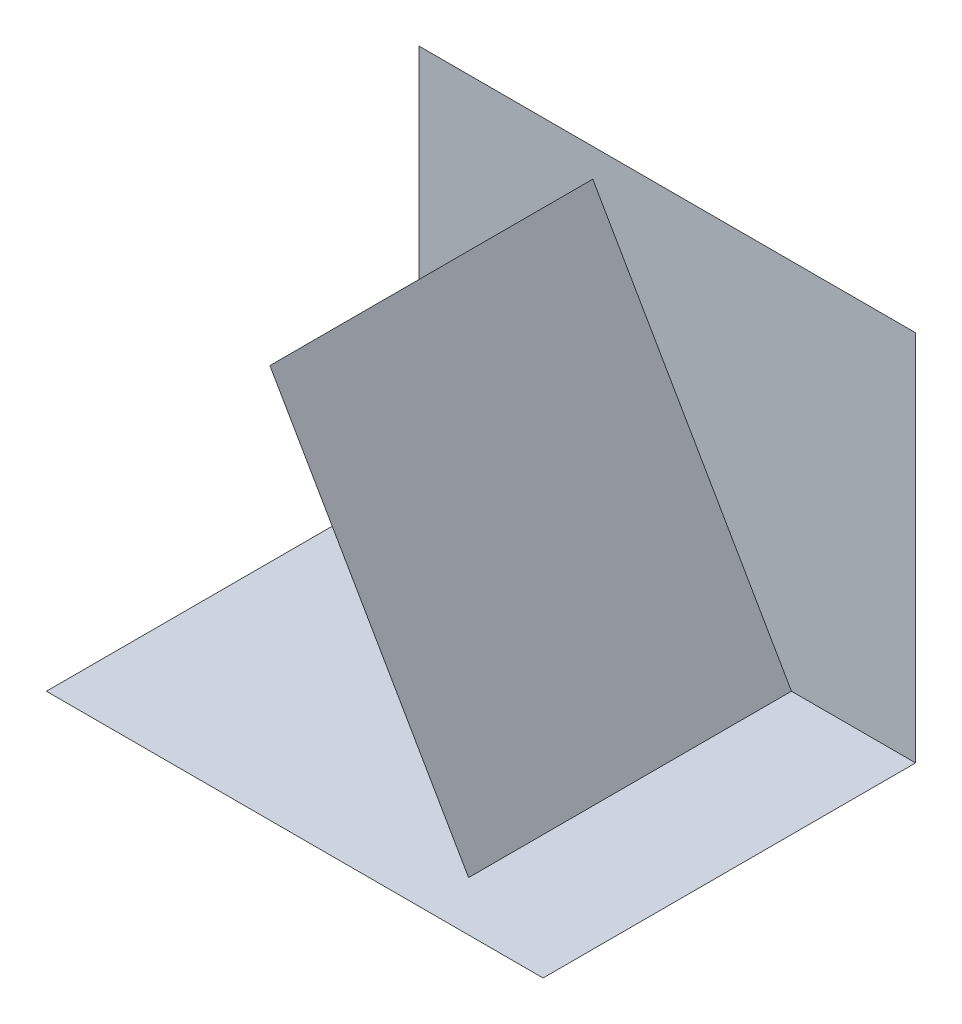
ISO-10303-21;
HEADER;
FILE_DESCRIPTION(('STEP AP214'),'2;1');
FILE_NAME('part.step','',(''),(''),'','','');
FILE_SCHEMA(('AUTOMOTIVE_DESIGN { 1 0 10303 214 1 1 1 1 }'));
ENDSEC;
DATA;
#1=APPLICATION_CONTEXT('core data for automotive mechanical design processes');
#2=APPLICATION_PROTOCOL_DEFINITION('international standard','automotive_design',2000,#1);
#3=PRODUCT_CONTEXT('',#1,'mechanical');
#4=PRODUCT('Part','Part','',(#3));
#5=PRODUCT_RELATED_PRODUCT_CATEGORY('part','',(#4));
#6=PRODUCT_DEFINITION_FORMATION('','',#4);
#7=PRODUCT_DEFINITION_CONTEXT('part definition',#1,'design');
#8=PRODUCT_DEFINITION('design','',#6,#7);
#9=PRODUCT_DEFINITION_SHAPE('','',#8);
#10=(LENGTH_UNIT() NAMED_UNIT(*) SI_UNIT(.MILLI.,.METRE.));
#11=(NAMED_UNIT(*) PLANE_ANGLE_UNIT() SI_UNIT($,.RADIAN.));
#12=(NAMED_UNIT(*) SI_UNIT($,.STERADIAN.) SOLID_ANGLE_UNIT());
#13=UNCERTAINTY_MEASURE_WITH_UNIT(LENGTH_MEASURE(1.E-05),#10,'distance_accuracy_value','');
#14=(GEOMETRIC_REPRESENTATION_CONTEXT(3) GLOBAL_UNCERTAINTY_ASSIGNED_CONTEXT((#13)) GLOBAL_UNIT_ASSIGNED_CONTEXT((#10,
#11,#12)) REPRESENTATION_CONTEXT('',''));
#15=CARTESIAN_POINT('',(0.,0.,0.));
#16=DIRECTION('',(0.,0.,1.));
#17=DIRECTION('',(1.,0.,0.));
#18=AXIS2_PLACEMENT_3D('',#15,#16,#17);
#19=CARTESIAN_POINT('',(-30.0000000000008,138.56406460551,0.));
#20=CARTESIAN_POINT('',(-30.0000000000008,138.56406460551,43.3333333333333));
#21=CARTESIAN_POINT('',(-30.0000000000008,138.56406460551,86.6666666666667));
#22=CARTESIAN_POINT('',(-30.0000000000008,138.56406460551,130.));
#23=CARTESIAN_POINT('',(-3.33333333333385,92.3760430703398,0.));
#24=CARTESIAN_POINT('',(-3.33333333333385,92.3760430703398,43.3333333333333));
#25=CARTESIAN_POINT('',(-3.33333333333386,92.3760430703398,86.6666666666667));
#26=CARTESIAN_POINT('',(-3.33333333333386,92.3760430703399,130.));
#27=CARTESIAN_POINT('',(23.3333333333331,46.1880215351699,0.));
#28=CARTESIAN_POINT('',(23.3333333333331,46.1880215351699,43.3333333333333));
#29=CARTESIAN_POINT('',(23.3333333333331,46.1880215351699,86.6666666666667));
#30=CARTESIAN_POINT('',(23.3333333333331,46.1880215351699,130.));
#31=CARTESIAN_POINT('',(50.,0.,0.));
#32=CARTESIAN_POINT('',(50.,0.,43.3333333333334));
#33=CARTESIAN_POINT('',(50.,0.,86.6666666666667));
#34=CARTESIAN_POINT('',(50.,0.,130.));
#35=B_SPLINE_SURFACE_WITH_KNOTS('',3,3,((#19,#20,#21,#22),(#23,#24,#25,#26),(#27,#28,#29,#30),
(#31,#32,#33,#34)),.UNSPECIFIED.,.F.,.F.,.F.,(4,4),(4,4),(0.,1.),(0.,1.),.UNSPECIFIED.);
#36=CARTESIAN_POINT('',(-30.0000000000008,138.56406460551,0.));
#37=CARTESIAN_POINT('',(-3.33333333333385,92.3760430703398,0.));
#38=CARTESIAN_POINT('',(23.3333333333331,46.1880215351699,0.));
#39=CARTESIAN_POINT('',(50.,0.,0.));
#40=B_SPLINE_CURVE_WITH_KNOTS('',3,(#36,#37,#38,#39),.UNSPECIFIED.,.F.,.F.,(4,4),(0.,1.),.UNSPECIFIED.);
#41=CARTESIAN_POINT('',(-30.0000000000008,138.56406460551,0.));
#42=VERTEX_POINT('',#41);
#43=CARTESIAN_POINT('',(50.,0.,0.));
#44=VERTEX_POINT('',#43);
#45=EDGE_CURVE('E14',#42,#44,#40,.T.);
#46=CARTESIAN_POINT('',(50.,0.,0.));
#47=CARTESIAN_POINT('',(50.,0.,43.3333333333334));
#48=CARTESIAN_POINT('',(50.,0.,86.6666666666667));
#49=CARTESIAN_POINT('',(50.,0.,130.));
#50=B_SPLINE_CURVE_WITH_KNOTS('',3,(#46,#47,#48,#49),.UNSPECIFIED.,.F.,.F.,(4,4),(0.,1.),.UNSPECIFIED.);
#51=CARTESIAN_POINT('',(50.,0.,130.));
#52=VERTEX_POINT('',#51);
#53=EDGE_CURVE('E73',#44,#52,#50,.T.);
#54=CARTESIAN_POINT('',(-30.0000000000008,138.56406460551,130.));
#55=CARTESIAN_POINT('',(-3.33333333333386,92.3760430703399,130.));
#56=CARTESIAN_POINT('',(23.3333333333331,46.1880215351699,130.));
#57=CARTESIAN_POINT('',(50.,0.,130.));
#58=B_SPLINE_CURVE_WITH_KNOTS('',3,(#54,#55,#56,#57),.UNSPECIFIED.,.F.,.F.,(4,4),(0.,1.),.UNSPECIFIED.);
#59=CARTESIAN_POINT('',(-30.0000000000008,138.56406460551,130.));
#60=VERTEX_POINT('',#59);
#61=EDGE_CURVE('E81',#52,#60,#58,.F.);
#62=CARTESIAN_POINT('',(-30.0000000000008,138.56406460551,0.));
#63=CARTESIAN_POINT('',(-30.0000000000008,138.56406460551,43.3333333333333));
#64=CARTESIAN_POINT('',(-30.0000000000008,138.56406460551,86.6666666666667));
#65=CARTESIAN_POINT('',(-30.0000000000008,138.56406460551,130.));
#66=B_SPLINE_CURVE_WITH_KNOTS('',3,(#62,#63,#64,#65),.UNSPECIFIED.,.F.,.F.,(4,4),(0.,1.),.UNSPECIFIED.);
#67=EDGE_CURVE('E65',#60,#42,#66,.F.);
#68=ORIENTED_EDGE('',*,*,#45,.T.);
#69=ORIENTED_EDGE('',*,*,#53,.T.);
#70=ORIENTED_EDGE('',*,*,#61,.T.);
#71=ORIENTED_EDGE('',*,*,#67,.T.);
#72=EDGE_LOOP('',(#68,#69,#70,#71));
#73=FACE_BOUND('',#72,.T.);
#74=ADVANCED_FACE('F62',(#73),#35,.T.);
#75=OPEN_SHELL('',(#74));
#76=SHELL_BASED_SURFACE_MODEL('B2',(#75));
#77=CARTESIAN_POINT('',(-100.,-0.0001,0.));
#78=DIRECTION('',(-1.,0.,0.));
#79=DIRECTION('',(0.,0.,1.));
#80=AXIS2_PLACEMENT_3D('',#77,#78,#79);
#81=PLANE('',#80);
#82=DIRECTION('',(0.,0.,1.));
#83=VECTOR('',#82,1.);
#84=CARTESIAN_POINT('',(-100.,0.,0.));
#85=LINE('',#84,#83);
#86=CARTESIAN_POINT('',(-100.,0.,0.));
#87=VERTEX_POINT('',#86);
#88=CARTESIAN_POINT('',(-100.,0.,150.));
#89=VERTEX_POINT('',#88);
#90=EDGE_CURVE('E180',#87,#89,#85,.T.);
#91=ORIENTED_EDGE('',*,*,#90,.F.);
#92=DIRECTION('',(0.,1.,0.));
#93=VECTOR('',#92,1.);
#94=CARTESIAN_POINT('',(-100.,-0.0001,0.));
#95=LINE('',#94,#93);
#96=CARTESIAN_POINT('',(-100.,-0.0001,0.));
#97=VERTEX_POINT('',#96);
#98=EDGE_CURVE('E60',#97,#87,#95,.T.);
#99=ORIENTED_EDGE('',*,*,#98,.F.);
#100=DIRECTION('',(0.,0.,1.));
#101=VECTOR('',#100,1.);
#102=CARTESIAN_POINT('',(-100.,-0.0001,0.));
#103=LINE('',#102,#101);
#104=CARTESIAN_POINT('',(-100.,-0.0001,150.));
#105=VERTEX_POINT('',#104);
#106=EDGE_CURVE('E182',#97,#105,#103,.T.);
#107=ORIENTED_EDGE('',*,*,#106,.T.);
#108=DIRECTION('',(0.,1.,0.));
#109=VECTOR('',#108,1.);
#110=CARTESIAN_POINT('',(-100.,-0.0001,150.));
#111=LINE('',#110,#109);
#112=EDGE_CURVE('E143',#105,#89,#111,.T.);
#113=ORIENTED_EDGE('',*,*,#112,.T.);
#114=EDGE_LOOP('',(#91,#99,#107,#113));
#115=FACE_BOUND('',#114,.T.);
#116=ADVANCED_FACE('F140',(#115),#81,.T.);
#117=CARTESIAN_POINT('',(-100.,-0.0001,0.));
#118=DIRECTION('',(0.,0.,-1.));
#119=DIRECTION('',(-1.,0.,0.));
#120=AXIS2_PLACEMENT_3D('',#117,#118,#119);
#121=PLANE('',#120);
#122=DIRECTION('',(-1.,0.,0.));
#123=VECTOR('',#122,1.);
#124=CARTESIAN_POINT('',(-100.,0.,0.));
#125=LINE('',#124,#123);
#126=CARTESIAN_POINT('',(100.,0.,0.));
#127=VERTEX_POINT('',#126);
#128=EDGE_CURVE('E197',#127,#87,#125,.T.);
#129=ORIENTED_EDGE('',*,*,#128,.F.);
#130=DIRECTION('',(0.,1.,0.));
#131=VECTOR('',#130,1.);
#132=CARTESIAN_POINT('',(100.,-0.0001,0.));
#133=LINE('',#132,#131);
#134=CARTESIAN_POINT('',(100.,-0.0001,0.));
#135=VERTEX_POINT('',#134);
#136=EDGE_CURVE('E148',#135,#127,#133,.T.);
#137=ORIENTED_EDGE('',*,*,#136,.F.);
#138=DIRECTION('',(-1.,0.,0.));
#139=VECTOR('',#138,1.);
#140=CARTESIAN_POINT('',(-100.,-0.0001,0.));
#141=LINE('',#140,#139);
#142=EDGE_CURVE('E187',#135,#97,#141,.T.);
#143=ORIENTED_EDGE('',*,*,#142,.T.);
#144=ORIENTED_EDGE('',*,*,#98,.T.);
#145=EDGE_LOOP('',(#129,#137,#143,#144));
#146=FACE_BOUND('',#145,.T.);
#147=ADVANCED_FACE('F212',(#146),#121,.T.);
#148=CARTESIAN_POINT('',(100.,-0.0001,0.));
#149=DIRECTION('',(1.,0.,0.));
#150=DIRECTION('',(0.,0.,-1.));
#151=AXIS2_PLACEMENT_3D('',#148,#149,#150);
#152=PLANE('',#151);
#153=DIRECTION('',(0.,0.,-1.));
#154=VECTOR('',#153,1.);
#155=CARTESIAN_POINT('',(100.,0.,0.));
#156=LINE('',#155,#154);
#157=CARTESIAN_POINT('',(100.,0.,150.));
#158=VERTEX_POINT('',#157);
#159=EDGE_CURVE('E194',#158,#127,#156,.T.);
#160=ORIENTED_EDGE('',*,*,#159,.F.);
#161=DIRECTION('',(0.,1.,0.));
#162=VECTOR('',#161,1.);
#163=CARTESIAN_POINT('',(100.,-0.0001,150.));
#164=LINE('',#163,#162);
#165=CARTESIAN_POINT('',(100.,-0.0001,150.));
#166=VERTEX_POINT('',#165);
#167=EDGE_CURVE('E186',#166,#158,#164,.T.);
#168=ORIENTED_EDGE('',*,*,#167,.F.);
#169=DIRECTION('',(0.,0.,-1.));
#170=VECTOR('',#169,1.);
#171=CARTESIAN_POINT('',(100.,-0.0001,0.));
#172=LINE('',#171,#170);
#173=EDGE_CURVE('E205',#166,#135,#172,.T.);
#174=ORIENTED_EDGE('',*,*,#173,.T.);
#175=ORIENTED_EDGE('',*,*,#136,.T.);
#176=EDGE_LOOP('',(#160,#168,#174,#175));
#177=FACE_BOUND('',#176,.T.);
#178=ADVANCED_FACE('F209',(#177),#152,.T.);
#179=CARTESIAN_POINT('',(-100.,-0.0001,150.));
#180=DIRECTION('',(0.,0.,1.));
#181=DIRECTION('',(1.,0.,0.));
#182=AXIS2_PLACEMENT_3D('',#179,#180,#181);
#183=PLANE('',#182);
#184=DIRECTION('',(1.,0.,0.));
#185=VECTOR('',#184,1.);
#186=CARTESIAN_POINT('',(-100.,0.,150.));
#187=LINE('',#186,#185);
#188=EDGE_CURVE('E189',#89,#158,#187,.T.);
#189=ORIENTED_EDGE('',*,*,#188,.F.);
#190=ORIENTED_EDGE('',*,*,#112,.F.);
#191=DIRECTION('',(1.,0.,0.));
#192=VECTOR('',#191,1.);
#193=CARTESIAN_POINT('',(-100.,-0.0001,150.));
#194=LINE('',#193,#192);
#195=EDGE_CURVE('E203',#105,#166,#194,.T.);
#196=ORIENTED_EDGE('',*,*,#195,.T.);
#197=ORIENTED_EDGE('',*,*,#167,.T.);
#198=EDGE_LOOP('',(#189,#190,#196,#197));
#199=FACE_BOUND('',#198,.T.);
#200=ADVANCED_FACE('F190',(#199),#183,.T.);
#201=CARTESIAN_POINT('',(-100.,-0.0001,150.));
#202=DIRECTION('',(0.,1.,0.));
#203=DIRECTION('',(0.,0.,1.));
#204=AXIS2_PLACEMENT_3D('',#201,#202,#203);
#205=PLANE('',#204);
#206=ORIENTED_EDGE('',*,*,#106,.F.);
#207=ORIENTED_EDGE('',*,*,#142,.F.);
#208=ORIENTED_EDGE('',*,*,#173,.F.);
#209=ORIENTED_EDGE('',*,*,#195,.F.);
#210=EDGE_LOOP('',(#206,#207,#208,#209));
#211=FACE_BOUND('',#210,.T.);
#212=ADVANCED_FACE('F214',(#211),#205,.F.);
#213=CARTESIAN_POINT('',(-100.,0.,150.));
#214=DIRECTION('',(0.,1.,0.));
#215=DIRECTION('',(0.,0.,1.));
#216=AXIS2_PLACEMENT_3D('',#213,#214,#215);
#217=PLANE('',#216);
#218=ORIENTED_EDGE('',*,*,#90,.T.);
#219=ORIENTED_EDGE('',*,*,#188,.T.);
#220=ORIENTED_EDGE('',*,*,#159,.T.);
#221=ORIENTED_EDGE('',*,*,#128,.T.);
#222=EDGE_LOOP('',(#218,#219,#220,#221));
#223=FACE_BOUND('',#222,.T.);
#224=ADVANCED_FACE('F196',(#223),#217,.T.);
#225=CLOSED_SHELL('',(#116,#147,#178,#200,#212,#224));
#226=MANIFOLD_SOLID_BREP('B8',#225);
#227=CARTESIAN_POINT('',(-100.,150.,-0.0001));
#228=DIRECTION('',(-1.,0.,0.));
#229=DIRECTION('',(0.,-1.,0.));
#230=AXIS2_PLACEMENT_3D('',#227,#228,#229);
#231=PLANE('',#230);
#232=DIRECTION('',(0.,-1.,0.));
#233=VECTOR('',#232,1.);
#234=CARTESIAN_POINT('',(-100.,150.,0.));
#235=LINE('',#234,#233);
#236=CARTESIAN_POINT('',(-100.,150.,0.));
#237=VERTEX_POINT('',#236);
#238=CARTESIAN_POINT('',(-100.,0.,0.));
#239=VERTEX_POINT('',#238);
#240=EDGE_CURVE('E292',#237,#239,#235,.T.);
#241=ORIENTED_EDGE('',*,*,#240,.F.);
#242=DIRECTION('',(0.,0.,1.));
#243=VECTOR('',#242,1.);
#244=CARTESIAN_POINT('',(-100.,150.,-0.0001));
#245=LINE('',#244,#243);
#246=CARTESIAN_POINT('',(-100.,150.,-0.0001));
#247=VERTEX_POINT('',#246);
#248=EDGE_CURVE('E138',#247,#237,#245,.T.);
#249=ORIENTED_EDGE('',*,*,#248,.F.);
#250=DIRECTION('',(0.,-1.,0.));
#251=VECTOR('',#250,1.);
#252=CARTESIAN_POINT('',(-100.,150.,-0.0001));
#253=LINE('',#252,#251);
#254=CARTESIAN_POINT('',(-100.,0.,-0.0001));
#255=VERTEX_POINT('',#254);
#256=EDGE_CURVE('E294',#247,#255,#253,.T.);
#257=ORIENTED_EDGE('',*,*,#256,.T.);
#258=DIRECTION('',(0.,0.,1.));
#259=VECTOR('',#258,1.);
#260=CARTESIAN_POINT('',(-100.,0.,-0.0001));
#261=LINE('',#260,#259);
#262=EDGE_CURVE('E255',#255,#239,#261,.T.);
#263=ORIENTED_EDGE('',*,*,#262,.T.);
#264=EDGE_LOOP('',(#241,#249,#257,#263));
#265=FACE_BOUND('',#264,.T.);
#266=ADVANCED_FACE('F252',(#265),#231,.T.);
#267=CARTESIAN_POINT('',(-100.,150.,-0.0001));
#268=DIRECTION('',(0.,1.,0.));
#269=DIRECTION('',(0.,0.,1.));
#270=AXIS2_PLACEMENT_3D('',#267,#268,#269);
#271=PLANE('',#270);
#272=DIRECTION('',(-1.,0.,0.));
#273=VECTOR('',#272,1.);
#274=CARTESIAN_POINT('',(-100.,150.,0.));
#275=LINE('',#274,#273);
#276=CARTESIAN_POINT('',(100.,150.,0.));
#277=VERTEX_POINT('',#276);
#278=EDGE_CURVE('E309',#277,#237,#275,.T.);
#279=ORIENTED_EDGE('',*,*,#278,.F.);
#280=DIRECTION('',(0.,0.,1.));
#281=VECTOR('',#280,1.);
#282=CARTESIAN_POINT('',(100.,150.,-0.0001));
#283=LINE('',#282,#281);
#284=CARTESIAN_POINT('',(100.,150.,-0.0001));
#285=VERTEX_POINT('',#284);
#286=EDGE_CURVE('E260',#285,#277,#283,.T.);
#287=ORIENTED_EDGE('',*,*,#286,.F.);
#288=DIRECTION('',(-1.,0.,0.));
#289=VECTOR('',#288,1.);
#290=CARTESIAN_POINT('',(-100.,150.,-0.0001));
#291=LINE('',#290,#289);
#292=EDGE_CURVE('E299',#285,#247,#291,.T.);
#293=ORIENTED_EDGE('',*,*,#292,.T.);
#294=ORIENTED_EDGE('',*,*,#248,.T.);
#295=EDGE_LOOP('',(#279,#287,#293,#294));
#296=FACE_BOUND('',#295,.T.);
#297=ADVANCED_FACE('F324',(#296),#271,.T.);
#298=CARTESIAN_POINT('',(100.,150.,-0.0001));
#299=DIRECTION('',(1.,0.,0.));
#300=DIRECTION('',(0.,1.,0.));
#301=AXIS2_PLACEMENT_3D('',#298,#299,#300);
#302=PLANE('',#301);
#303=DIRECTION('',(0.,1.,0.));
#304=VECTOR('',#303,1.);
#305=CARTESIAN_POINT('',(100.,150.,0.));
#306=LINE('',#305,#304);
#307=CARTESIAN_POINT('',(100.,0.,0.));
#308=VERTEX_POINT('',#307);
#309=EDGE_CURVE('E306',#308,#277,#306,.T.);
#310=ORIENTED_EDGE('',*,*,#309,.F.);
#311=DIRECTION('',(0.,0.,1.));
#312=VECTOR('',#311,1.);
#313=CARTESIAN_POINT('',(100.,0.,-0.0001));
#314=LINE('',#313,#312);
#315=CARTESIAN_POINT('',(100.,0.,-0.0001));
#316=VERTEX_POINT('',#315);
#317=EDGE_CURVE('E298',#316,#308,#314,.T.);
#318=ORIENTED_EDGE('',*,*,#317,.F.);
#319=DIRECTION('',(0.,1.,0.));
#320=VECTOR('',#319,1.);
#321=CARTESIAN_POINT('',(100.,150.,-0.0001));
#322=LINE('',#321,#320);
#323=EDGE_CURVE('E317',#316,#285,#322,.T.);
#324=ORIENTED_EDGE('',*,*,#323,.T.);
#325=ORIENTED_EDGE('',*,*,#286,.T.);
#326=EDGE_LOOP('',(#310,#318,#324,#325));
#327=FACE_BOUND('',#326,.T.);
#328=ADVANCED_FACE('F321',(#327),#302,.T.);
#329=CARTESIAN_POINT('',(-100.,0.,-0.0001));
#330=DIRECTION('',(0.,-1.,0.));
#331=DIRECTION('',(0.,0.,-1.));
#332=AXIS2_PLACEMENT_3D('',#329,#330,#331);
#333=PLANE('',#332);
#334=DIRECTION('',(1.,0.,0.));
#335=VECTOR('',#334,1.);
#336=CARTESIAN_POINT('',(-100.,0.,0.));
#337=LINE('',#336,#335);
#338=EDGE_CURVE('E301',#239,#308,#337,.T.);
#339=ORIENTED_EDGE('',*,*,#338,.F.);
#340=ORIENTED_EDGE('',*,*,#262,.F.);
#341=DIRECTION('',(1.,0.,0.));
#342=VECTOR('',#341,1.);
#343=CARTESIAN_POINT('',(-100.,0.,-0.0001));
#344=LINE('',#343,#342);
#345=EDGE_CURVE('E315',#255,#316,#344,.T.);
#346=ORIENTED_EDGE('',*,*,#345,.T.);
#347=ORIENTED_EDGE('',*,*,#317,.T.);
#348=EDGE_LOOP('',(#339,#340,#346,#347));
#349=FACE_BOUND('',#348,.T.);
#350=ADVANCED_FACE('F302',(#349),#333,.T.);
#351=CARTESIAN_POINT('',(-100.,0.,-0.0001));
#352=DIRECTION('',(0.,0.,1.));
#353=DIRECTION('',(1.,0.,0.));
#354=AXIS2_PLACEMENT_3D('',#351,#352,#353);
#355=PLANE('',#354);
#356=ORIENTED_EDGE('',*,*,#256,.F.);
#357=ORIENTED_EDGE('',*,*,#292,.F.);
#358=ORIENTED_EDGE('',*,*,#323,.F.);
#359=ORIENTED_EDGE('',*,*,#345,.F.);
#360=EDGE_LOOP('',(#356,#357,#358,#359));
#361=FACE_BOUND('',#360,.T.);
#362=ADVANCED_FACE('F326',(#361),#355,.F.);
#363=CARTESIAN_POINT('',(-100.,0.,0.));
#364=DIRECTION('',(0.,0.,1.));
#365=DIRECTION('',(1.,0.,0.));
#366=AXIS2_PLACEMENT_3D('',#363,#364,#365);
#367=PLANE('',#366);
#368=ORIENTED_EDGE('',*,*,#240,.T.);
#369=ORIENTED_EDGE('',*,*,#338,.T.);
#370=ORIENTED_EDGE('',*,*,#309,.T.);
#371=ORIENTED_EDGE('',*,*,#278,.T.);
#372=EDGE_LOOP('',(#368,#369,#370,#371));
#373=FACE_BOUND('',#372,.T.);
#374=ADVANCED_FACE('F308',(#373),#367,.T.);
#375=CLOSED_SHELL('',(#266,#297,#328,#350,#362,#374));
#376=MANIFOLD_SOLID_BREP('B54',#375);
#377=ADVANCED_BREP_SHAPE_REPRESENTATION('',(#18,#226,#376),#14);
#378=MANIFOLD_SURFACE_SHAPE_REPRESENTATION('',(#18,#76),#14);
#379=SHAPE_REPRESENTATION('',(#18),#14);
#380=SHAPE_DEFINITION_REPRESENTATION(#9,#379);
#381=SHAPE_REPRESENTATION_RELATIONSHIP('','',#379,#377);
#382=SHAPE_REPRESENTATION_RELATIONSHIP('','',#379,#378);
ENDSEC;
END-ISO-10303-21;
